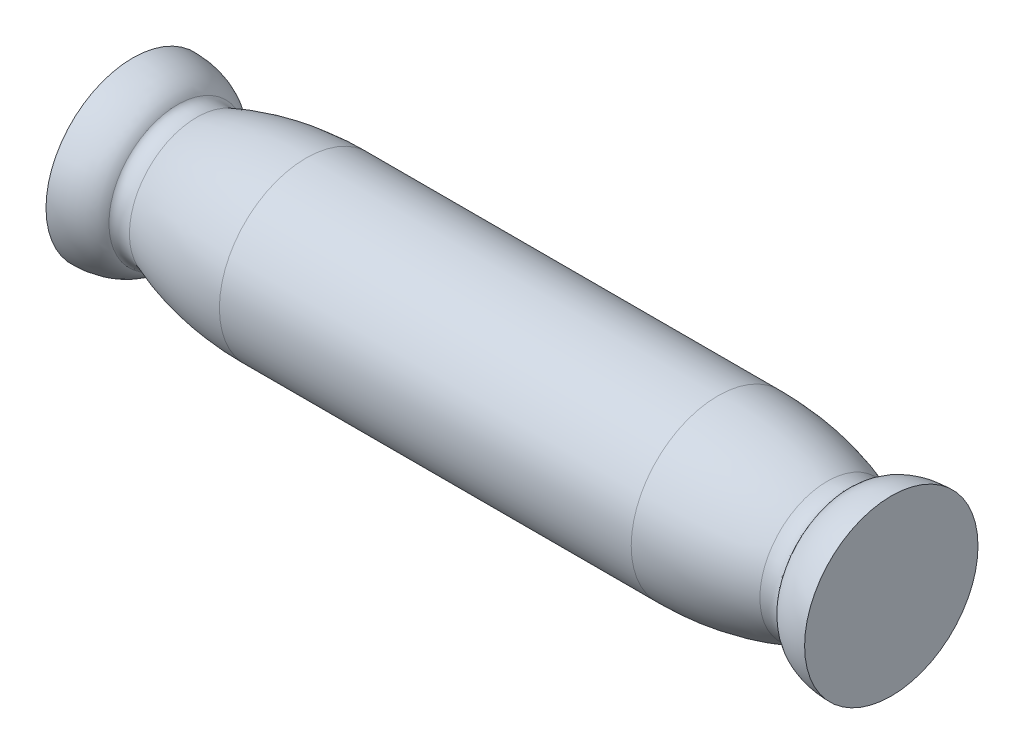
ISO-10303-21;
HEADER;
FILE_DESCRIPTION(('STEP AP214'),'2;1');
FILE_NAME('part.step','',(''),(''),'','','');
FILE_SCHEMA(('AUTOMOTIVE_DESIGN { 1 0 10303 214 1 1 1 1 }'));
ENDSEC;
DATA;
#1=APPLICATION_CONTEXT('core data for automotive mechanical design processes');
#2=APPLICATION_PROTOCOL_DEFINITION('international standard','automotive_design',2000,#1);
#3=PRODUCT_CONTEXT('',#1,'mechanical');
#4=PRODUCT('Part','Part','',(#3));
#5=PRODUCT_RELATED_PRODUCT_CATEGORY('part','',(#4));
#6=PRODUCT_DEFINITION_FORMATION('','',#4);
#7=PRODUCT_DEFINITION_CONTEXT('part definition',#1,'design');
#8=PRODUCT_DEFINITION('design','',#6,#7);
#9=PRODUCT_DEFINITION_SHAPE('','',#8);
#10=(LENGTH_UNIT() NAMED_UNIT(*) SI_UNIT(.MILLI.,.METRE.));
#11=(NAMED_UNIT(*) PLANE_ANGLE_UNIT() SI_UNIT($,.RADIAN.));
#12=(NAMED_UNIT(*) SI_UNIT($,.STERADIAN.) SOLID_ANGLE_UNIT());
#13=UNCERTAINTY_MEASURE_WITH_UNIT(LENGTH_MEASURE(1.E-05),#10,'distance_accuracy_value','');
#14=(GEOMETRIC_REPRESENTATION_CONTEXT(3) GLOBAL_UNCERTAINTY_ASSIGNED_CONTEXT((#13)) GLOBAL_UNIT_ASSIGNED_CONTEXT((#10,
#11,#12)) REPRESENTATION_CONTEXT('',''));
#15=CARTESIAN_POINT('',(0.,0.,0.));
#16=DIRECTION('',(0.,0.,1.));
#17=DIRECTION('',(1.,0.,0.));
#18=AXIS2_PLACEMENT_3D('',#15,#16,#17);
#19=CARTESIAN_POINT('',(0.,0.,0.));
#20=DIRECTION('',(1.,0.,0.));
#21=DIRECTION('',(0.,0.,-1.));
#22=AXIS2_PLACEMENT_3D('',#19,#20,#21);
#23=PLANE('',#22);
#24=DIRECTION('',(0.,0.,1.));
#25=VECTOR('',#24,1.);
#26=CARTESIAN_POINT('',(0.,-1.,-1.24899959967968));
#27=LINE('',#26,#25);
#28=CARTESIAN_POINT('',(0.,-1.,-1.24899959967968));
#29=VERTEX_POINT('',#28);
#30=CARTESIAN_POINT('',(0.,-1.,1.24899959967968));
#31=VERTEX_POINT('',#30);
#32=EDGE_CURVE('E66',#29,#31,#27,.T.);
#33=ORIENTED_EDGE('',*,*,#32,.F.);
#34=CARTESIAN_POINT('',(0.,0.,0.));
#35=DIRECTION('',(-1.,0.,0.));
#36=DIRECTION('',(0.,0.,1.));
#37=AXIS2_PLACEMENT_3D('',#34,#35,#36);
#38=CIRCLE('',#37,1.6);
#39=EDGE_CURVE('E50',#31,#29,#38,.T.);
#40=ORIENTED_EDGE('',*,*,#39,.F.);
#41=EDGE_LOOP('',(#33,#40));
#42=FACE_BOUND('',#41,.T.);
#43=CARTESIAN_POINT('',(0.,0.,0.));
#44=DIRECTION('',(-1.,0.,0.));
#45=DIRECTION('',(0.,0.,1.));
#46=AXIS2_PLACEMENT_3D('',#43,#44,#45);
#47=CIRCLE('',#46,4.);
#48=CARTESIAN_POINT('',(0.,0.,4.));
#49=VERTEX_POINT('',#48);
#50=EDGE_CURVE('E83',#49,#49,#47,.T.);
#51=ORIENTED_EDGE('',*,*,#50,.T.);
#52=EDGE_LOOP('',(#51));
#53=FACE_BOUND('',#52,.T.);
#54=ADVANCED_FACE('F36',(#42,#53),#23,.F.);
#55=CARTESIAN_POINT('',(9.8,0.,0.));
#56=DIRECTION('',(-1.,0.,0.));
#57=DIRECTION('',(0.,0.,1.));
#58=AXIS2_PLACEMENT_3D('',#55,#56,#57);
#59=CYLINDRICAL_SURFACE('',#58,1.6);
#60=ORIENTED_EDGE('',*,*,#39,.T.);
#61=DIRECTION('',(-1.,0.,0.));
#62=VECTOR('',#61,1.);
#63=CARTESIAN_POINT('',(9.8,-1.,-1.24899959967968));
#64=LINE('',#63,#62);
#65=CARTESIAN_POINT('',(9.8,-1.,-1.24899959967968));
#66=VERTEX_POINT('',#65);
#67=EDGE_CURVE('E40',#66,#29,#64,.T.);
#68=ORIENTED_EDGE('',*,*,#67,.F.);
#69=CARTESIAN_POINT('',(9.8,0.,0.));
#70=DIRECTION('',(-1.,0.,0.));
#71=DIRECTION('',(0.,0.,1.));
#72=AXIS2_PLACEMENT_3D('',#69,#70,#71);
#73=CIRCLE('',#72,1.6);
#74=CARTESIAN_POINT('',(9.8,-1.,1.24899959967968));
#75=VERTEX_POINT('',#74);
#76=EDGE_CURVE('E63',#75,#66,#73,.T.);
#77=ORIENTED_EDGE('',*,*,#76,.F.);
#78=DIRECTION('',(-1.,0.,0.));
#79=VECTOR('',#78,1.);
#80=CARTESIAN_POINT('',(9.8,-1.,1.24899959967968));
#81=LINE('',#80,#79);
#82=EDGE_CURVE('E11',#75,#31,#81,.T.);
#83=ORIENTED_EDGE('',*,*,#82,.T.);
#84=EDGE_LOOP('',(#60,#68,#77,#83));
#85=FACE_BOUND('',#84,.T.);
#86=ADVANCED_FACE('F61',(#85),#59,.F.);
#87=CARTESIAN_POINT('',(9.8,-1.,-1.24899959967968));
#88=DIRECTION('',(0.,-1.,0.));
#89=DIRECTION('',(0.,0.,-1.));
#90=AXIS2_PLACEMENT_3D('',#87,#88,#89);
#91=PLANE('',#90);
#92=ORIENTED_EDGE('',*,*,#32,.T.);
#93=ORIENTED_EDGE('',*,*,#82,.F.);
#94=DIRECTION('',(0.,0.,1.));
#95=VECTOR('',#94,1.);
#96=CARTESIAN_POINT('',(9.8,-1.,-1.24899959967968));
#97=LINE('',#96,#95);
#98=EDGE_CURVE('E77',#66,#75,#97,.T.);
#99=ORIENTED_EDGE('',*,*,#98,.F.);
#100=ORIENTED_EDGE('',*,*,#67,.T.);
#101=EDGE_LOOP('',(#92,#93,#99,#100));
#102=FACE_BOUND('',#101,.T.);
#103=ADVANCED_FACE('F67',(#102),#91,.F.);
#104=CARTESIAN_POINT('',(9.8,0.,0.));
#105=DIRECTION('',(-1.,0.,0.));
#106=DIRECTION('',(0.,0.,1.));
#107=AXIS2_PLACEMENT_3D('',#104,#105,#106);
#108=PLANE('',#107);
#109=ORIENTED_EDGE('',*,*,#76,.T.);
#110=ORIENTED_EDGE('',*,*,#98,.T.);
#111=EDGE_LOOP('',(#109,#110));
#112=FACE_BOUND('',#111,.T.);
#113=ADVANCED_FACE('F109',(#112),#108,.T.);
#114=CARTESIAN_POINT('',(0.,2.81593368748895,0.));
#115=DIRECTION('',(0.,0.,-1.));
#116=DIRECTION('',(-1.,0.,0.));
#117=AXIS2_PLACEMENT_3D('',#114,#115,#116);
#118=ELLIPSE('',#117,2.16380688391382,1.18406631251105);
#119=CARTESIAN_POINT('',(0.,0.,0.));
#120=DIRECTION('',(-1.,0.,0.));
#121=AXIS1_PLACEMENT('',#119,#120);
#122=SURFACE_OF_REVOLUTION('',#118,#121);
#123=CARTESIAN_POINT('',(2.06805943293506,0.,0.));
#124=DIRECTION('',(-1.,0.,0.));
#125=DIRECTION('',(0.,0.,1.));
#126=AXIS2_PLACEMENT_3D('',#123,#124,#125);
#127=CIRCLE('',#126,3.16426066202688);
#128=CARTESIAN_POINT('',(2.06805943293506,0.,3.16426066202688));
#129=VERTEX_POINT('',#128);
#130=EDGE_CURVE('E71',#129,#129,#127,.T.);
#131=ORIENTED_EDGE('',*,*,#130,.T.);
#132=EDGE_LOOP('',(#131));
#133=FACE_BOUND('',#132,.T.);
#134=ORIENTED_EDGE('',*,*,#50,.F.);
#135=EDGE_LOOP('',(#134));
#136=FACE_BOUND('',#135,.T.);
#137=ADVANCED_FACE('F131',(#133,#136),#122,.F.);
#138=CARTESIAN_POINT('',(3.10383422547744,4.,0.));
#139=DIRECTION('',(0.,0.,1.));
#140=DIRECTION('',(-0.778252534176558,-0.627951425707247,0.));
#141=AXIS2_PLACEMENT_3D('',#138,#139,#140);
#142=ELLIPSE('',#141,1.33089806593216,0.698243609420521);
#143=CARTESIAN_POINT('',(0.,0.,0.));
#144=DIRECTION('',(-1.,0.,0.));
#145=AXIS1_PLACEMENT('',#143,#144);
#146=SURFACE_OF_REVOLUTION('',#142,#145);
#147=CARTESIAN_POINT('',(2.95613049770992,0.,0.));
#148=DIRECTION('',(-1.,0.,0.));
#149=DIRECTION('',(0.,0.,1.));
#150=AXIS2_PLACEMENT_3D('',#147,#148,#149);
#151=CIRCLE('',#150,3.10769181317555);
#152=CARTESIAN_POINT('',(2.95613049770992,0.,3.10769181317555));
#153=VERTEX_POINT('',#152);
#154=EDGE_CURVE('E74',#153,#153,#151,.T.);
#155=ORIENTED_EDGE('',*,*,#154,.T.);
#156=EDGE_LOOP('',(#155));
#157=FACE_BOUND('',#156,.T.);
#158=ORIENTED_EDGE('',*,*,#130,.F.);
#159=EDGE_LOOP('',(#158));
#160=FACE_BOUND('',#159,.T.);
#161=ADVANCED_FACE('F128',(#157,#160),#146,.F.);
#162=CARTESIAN_POINT('',(8.,-0.416725599461318,0.));
#163=DIRECTION('',(0.,0.,-1.));
#164=DIRECTION('',(-1.,0.,0.));
#165=AXIS2_PLACEMENT_3D('',#162,#163,#164);
#166=ELLIPSE('',#165,8.36884092214439,4.41672559946132);
#167=TRIMMED_CURVE('',#166,(PARAMETER_VALUE(0.094492261076567)),
(PARAMETER_VALUE(3.04710039251323)),.T.,.PARAMETER.);
#168=CARTESIAN_POINT('',(0.,0.,0.));
#169=DIRECTION('',(-1.,0.,0.));
#170=AXIS1_PLACEMENT('',#168,#169);
#171=SURFACE_OF_REVOLUTION('',#167,#170);
#172=CARTESIAN_POINT('',(8.,0.,0.));
#173=DIRECTION('',(-1.,0.,0.));
#174=DIRECTION('',(0.,0.,1.));
#175=AXIS2_PLACEMENT_3D('',#172,#173,#174);
#176=CIRCLE('',#175,4.);
#177=CARTESIAN_POINT('',(8.,0.,4.));
#178=VERTEX_POINT('',#177);
#179=EDGE_CURVE('E115',#178,#178,#176,.T.);
#180=ORIENTED_EDGE('',*,*,#179,.T.);
#181=EDGE_LOOP('',(#180));
#182=FACE_BOUND('',#181,.T.);
#183=ORIENTED_EDGE('',*,*,#154,.F.);
#184=EDGE_LOOP('',(#183));
#185=FACE_BOUND('',#184,.T.);
#186=ADVANCED_FACE('F125',(#182,#185),#171,.F.);
#187=CARTESIAN_POINT('',(35.,0.,0.));
#188=DIRECTION('',(-1.,0.,0.));
#189=DIRECTION('',(0.,0.,1.));
#190=AXIS2_PLACEMENT_3D('',#187,#188,#189);
#191=CYLINDRICAL_SURFACE('',#190,4.);
#192=CARTESIAN_POINT('',(27.,0.,0.));
#193=DIRECTION('',(-1.,0.,0.));
#194=DIRECTION('',(0.,0.,1.));
#195=AXIS2_PLACEMENT_3D('',#192,#193,#194);
#196=CIRCLE('',#195,4.);
#197=CARTESIAN_POINT('',(27.,0.,4.));
#198=VERTEX_POINT('',#197);
#199=EDGE_CURVE('E87',#198,#198,#196,.T.);
#200=ORIENTED_EDGE('',*,*,#199,.T.);
#201=EDGE_LOOP('',(#200));
#202=FACE_BOUND('',#201,.T.);
#203=ORIENTED_EDGE('',*,*,#179,.F.);
#204=EDGE_LOOP('',(#203));
#205=FACE_BOUND('',#204,.T.);
#206=ADVANCED_FACE('F38',(#202,#205),#191,.T.);
#207=CARTESIAN_POINT('',(35.,2.81593368748895,0.));
#208=DIRECTION('',(0.,0.,-1.));
#209=DIRECTION('',(1.,0.,0.));
#210=AXIS2_PLACEMENT_3D('',#207,#208,#209);
#211=ELLIPSE('',#210,2.16380688391382,1.18406631251105);
#212=CARTESIAN_POINT('',(0.,0.,0.));
#213=DIRECTION('',(-1.,0.,0.));
#214=AXIS1_PLACEMENT('',#212,#213);
#215=SURFACE_OF_REVOLUTION('',#211,#214);
#216=CARTESIAN_POINT('',(35.,0.,0.));
#217=DIRECTION('',(-1.,0.,0.));
#218=DIRECTION('',(0.,0.,1.));
#219=AXIS2_PLACEMENT_3D('',#216,#217,#218);
#220=CIRCLE('',#219,4.);
#221=CARTESIAN_POINT('',(35.,0.,4.));
#222=VERTEX_POINT('',#221);
#223=EDGE_CURVE('E90',#222,#222,#220,.T.);
#224=ORIENTED_EDGE('',*,*,#223,.T.);
#225=EDGE_LOOP('',(#224));
#226=FACE_BOUND('',#225,.T.);
#227=CARTESIAN_POINT('',(32.9319405670649,0.,0.));
#228=DIRECTION('',(-1.,0.,0.));
#229=DIRECTION('',(0.,0.,1.));
#230=AXIS2_PLACEMENT_3D('',#227,#228,#229);
#231=CIRCLE('',#230,3.16426066202688);
#232=CARTESIAN_POINT('',(32.9319405670649,0.,3.16426066202688));
#233=VERTEX_POINT('',#232);
#234=EDGE_CURVE('E80',#233,#233,#231,.T.);
#235=ORIENTED_EDGE('',*,*,#234,.F.);
#236=EDGE_LOOP('',(#235));
#237=FACE_BOUND('',#236,.T.);
#238=ADVANCED_FACE('F103',(#226,#237),#215,.F.);
#239=CARTESIAN_POINT('',(31.8961657745226,4.,0.));
#240=DIRECTION('',(0.,0.,1.));
#241=DIRECTION('',(0.778252534176558,-0.627951425707248,0.));
#242=AXIS2_PLACEMENT_3D('',#239,#240,#241);
#243=ELLIPSE('',#242,1.33089806593216,0.69824360942052);
#244=CARTESIAN_POINT('',(0.,0.,0.));
#245=DIRECTION('',(-1.,0.,0.));
#246=AXIS1_PLACEMENT('',#244,#245);
#247=SURFACE_OF_REVOLUTION('',#243,#246);
#248=ORIENTED_EDGE('',*,*,#234,.T.);
#249=EDGE_LOOP('',(#248));
#250=FACE_BOUND('',#249,.T.);
#251=CARTESIAN_POINT('',(32.0438695022901,0.,0.));
#252=DIRECTION('',(-1.,0.,0.));
#253=DIRECTION('',(0.,0.,1.));
#254=AXIS2_PLACEMENT_3D('',#251,#252,#253);
#255=CIRCLE('',#254,3.10769181317556);
#256=CARTESIAN_POINT('',(32.0438695022901,0.,3.10769181317556));
#257=VERTEX_POINT('',#256);
#258=EDGE_CURVE('E84',#257,#257,#255,.T.);
#259=ORIENTED_EDGE('',*,*,#258,.F.);
#260=EDGE_LOOP('',(#259));
#261=FACE_BOUND('',#260,.T.);
#262=ADVANCED_FACE('F98',(#250,#261),#247,.F.);
#263=CARTESIAN_POINT('',(27.,-0.416725599461315,0.));
#264=DIRECTION('',(0.,0.,-1.));
#265=DIRECTION('',(1.,0.,0.));
#266=AXIS2_PLACEMENT_3D('',#263,#264,#265);
#267=ELLIPSE('',#266,8.36884092214438,4.41672559946132);
#268=TRIMMED_CURVE('',#267,(PARAMETER_VALUE(3.23608491466636)),
(PARAMETER_VALUE(6.18869304610302)),.T.,.PARAMETER.);
#269=CARTESIAN_POINT('',(0.,0.,0.));
#270=DIRECTION('',(-1.,0.,0.));
#271=AXIS1_PLACEMENT('',#269,#270);
#272=SURFACE_OF_REVOLUTION('',#268,#271);
#273=ORIENTED_EDGE('',*,*,#258,.T.);
#274=EDGE_LOOP('',(#273));
#275=FACE_BOUND('',#274,.T.);
#276=ORIENTED_EDGE('',*,*,#199,.F.);
#277=EDGE_LOOP('',(#276));
#278=FACE_BOUND('',#277,.T.);
#279=ADVANCED_FACE('F102',(#275,#278),#272,.F.);
#280=CARTESIAN_POINT('',(35.,0.,0.));
#281=DIRECTION('',(1.,0.,0.));
#282=DIRECTION('',(0.,0.,-1.));
#283=AXIS2_PLACEMENT_3D('',#280,#281,#282);
#284=PLANE('',#283);
#285=ORIENTED_EDGE('',*,*,#223,.F.);
#286=EDGE_LOOP('',(#285));
#287=FACE_BOUND('',#286,.T.);
#288=ADVANCED_FACE('F147',(#287),#284,.T.);
#289=CLOSED_SHELL('',(#54,#86,#103,#113,#137,#161,#186,#206,#238,#262,#279,#288));
#290=MANIFOLD_SOLID_BREP('B2',#289);
#291=ADVANCED_BREP_SHAPE_REPRESENTATION('',(#18,#290),#14);
#292=SHAPE_DEFINITION_REPRESENTATION(#9,#291);
ENDSEC;
END-ISO-10303-21;
